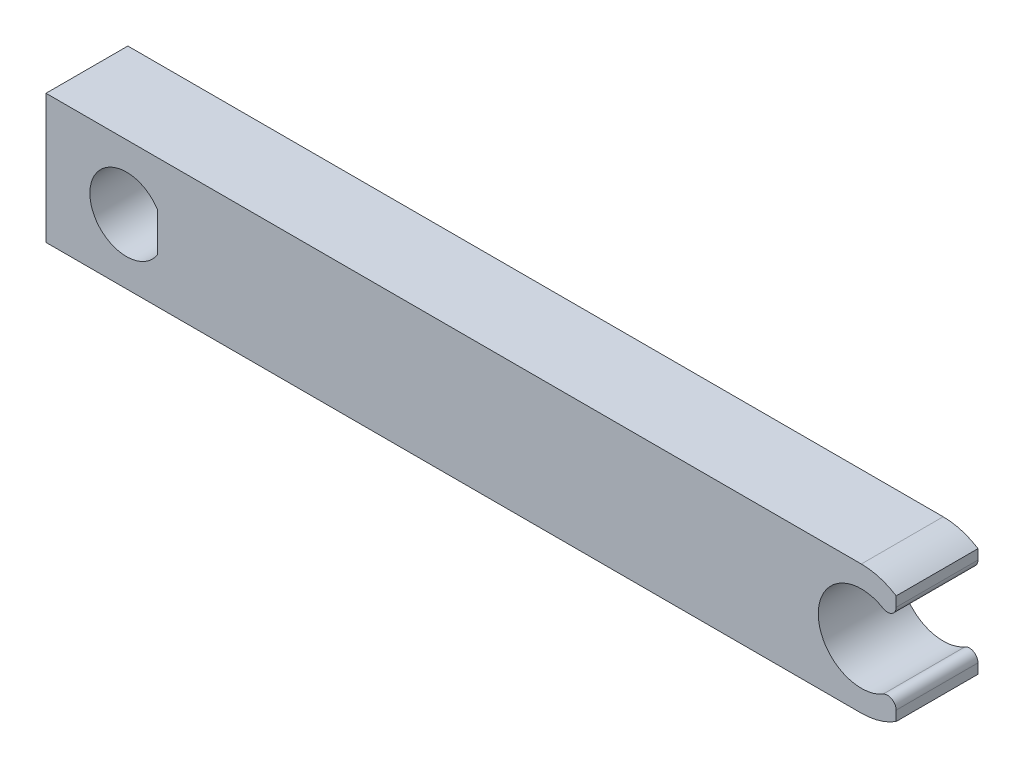
ISO-10303-21;
HEADER;
FILE_DESCRIPTION(('STEP AP214'),'2;1');
FILE_NAME('part.step','',(''),(''),'','','');
FILE_SCHEMA(('AUTOMOTIVE_DESIGN { 1 0 10303 214 1 1 1 1 }'));
ENDSEC;
DATA;
#1=APPLICATION_CONTEXT('core data for automotive mechanical design processes');
#2=APPLICATION_PROTOCOL_DEFINITION('international standard','automotive_design',2000,#1);
#3=PRODUCT_CONTEXT('',#1,'mechanical');
#4=PRODUCT('Part','Part','',(#3));
#5=PRODUCT_RELATED_PRODUCT_CATEGORY('part','',(#4));
#6=PRODUCT_DEFINITION_FORMATION('','',#4);
#7=PRODUCT_DEFINITION_CONTEXT('part definition',#1,'design');
#8=PRODUCT_DEFINITION('design','',#6,#7);
#9=PRODUCT_DEFINITION_SHAPE('','',#8);
#10=(LENGTH_UNIT() NAMED_UNIT(*) SI_UNIT(.MILLI.,.METRE.));
#11=(NAMED_UNIT(*) PLANE_ANGLE_UNIT() SI_UNIT($,.RADIAN.));
#12=(NAMED_UNIT(*) SI_UNIT($,.STERADIAN.) SOLID_ANGLE_UNIT());
#13=UNCERTAINTY_MEASURE_WITH_UNIT(LENGTH_MEASURE(1.E-05),#10,'distance_accuracy_value','');
#14=(GEOMETRIC_REPRESENTATION_CONTEXT(3) GLOBAL_UNCERTAINTY_ASSIGNED_CONTEXT((#13)) GLOBAL_UNIT_ASSIGNED_CONTEXT((#10,
#11,#12)) REPRESENTATION_CONTEXT('',''));
#15=CARTESIAN_POINT('',(0.,0.,0.));
#16=DIRECTION('',(0.,0.,1.));
#17=DIRECTION('',(1.,0.,0.));
#18=AXIS2_PLACEMENT_3D('',#15,#16,#17);
#19=CARTESIAN_POINT('',(0.,12.,7.6));
#20=DIRECTION('',(0.,1.,0.));
#21=DIRECTION('',(-1.,0.,0.));
#22=AXIS2_PLACEMENT_3D('',#19,#20,#21);
#23=PLANE('',#22);
#24=DIRECTION('',(1.,0.,0.));
#25=VECTOR('',#24,1.);
#26=CARTESIAN_POINT('',(0.,12.,0.));
#27=LINE('',#26,#25);
#28=CARTESIAN_POINT('',(-21.8018919920063,11.9999999999999,0.));
#29=VERTEX_POINT('',#28);
#30=CARTESIAN_POINT('',(53.9156905575242,12.,0.));
#31=VERTEX_POINT('',#30);
#32=EDGE_CURVE('E158',#29,#31,#27,.T.);
#33=ORIENTED_EDGE('',*,*,#32,.F.);
#34=DIRECTION('',(0.,0.,-1.));
#35=VECTOR('',#34,1.);
#36=CARTESIAN_POINT('',(-21.8018919920063,11.9999999999999,7.6));
#37=LINE('',#36,#35);
#38=CARTESIAN_POINT('',(-21.8018919920063,11.9999999999999,7.6));
#39=VERTEX_POINT('',#38);
#40=EDGE_CURVE('E246',#39,#29,#37,.T.);
#41=ORIENTED_EDGE('',*,*,#40,.F.);
#42=DIRECTION('',(1.,0.,0.));
#43=VECTOR('',#42,1.);
#44=CARTESIAN_POINT('',(0.,12.,7.6));
#45=LINE('',#44,#43);
#46=CARTESIAN_POINT('',(53.9156905575242,12.,7.6));
#47=VERTEX_POINT('',#46);
#48=EDGE_CURVE('E172',#39,#47,#45,.T.);
#49=ORIENTED_EDGE('',*,*,#48,.T.);
#50=DIRECTION('',(0.,0.,-1.));
#51=VECTOR('',#50,1.);
#52=CARTESIAN_POINT('',(53.9156905575242,12.,7.6));
#53=LINE('',#52,#51);
#54=EDGE_CURVE('E145',#47,#31,#53,.T.);
#55=ORIENTED_EDGE('',*,*,#54,.T.);
#56=EDGE_LOOP('',(#33,#41,#49,#55));
#57=FACE_BOUND('',#56,.T.);
#58=ADVANCED_FACE('F45',(#57),#23,.T.);
#59=CARTESIAN_POINT('',(-21.8018919920063,0.,7.6));
#60=DIRECTION('',(1.,0.,0.));
#61=DIRECTION('',(0.,1.,0.));
#62=AXIS2_PLACEMENT_3D('',#59,#60,#61);
#63=PLANE('',#62);
#64=DIRECTION('',(0.,-1.,0.));
#65=VECTOR('',#64,1.);
#66=CARTESIAN_POINT('',(-21.8018919920063,0.,0.));
#67=LINE('',#66,#65);
#68=CARTESIAN_POINT('',(-21.8018919920063,0.,0.));
#69=VERTEX_POINT('',#68);
#70=EDGE_CURVE('E201',#29,#69,#67,.T.);
#71=ORIENTED_EDGE('',*,*,#70,.T.);
#72=DIRECTION('',(0.,0.,-1.));
#73=VECTOR('',#72,1.);
#74=CARTESIAN_POINT('',(-21.8018919920063,0.,7.6));
#75=LINE('',#74,#73);
#76=CARTESIAN_POINT('',(-21.8018919920063,0.,7.6));
#77=VERTEX_POINT('',#76);
#78=EDGE_CURVE('E242',#77,#69,#75,.T.);
#79=ORIENTED_EDGE('',*,*,#78,.F.);
#80=DIRECTION('',(0.,-1.,0.));
#81=VECTOR('',#80,1.);
#82=CARTESIAN_POINT('',(-21.8018919920063,0.,7.6));
#83=LINE('',#82,#81);
#84=EDGE_CURVE('E176',#39,#77,#83,.T.);
#85=ORIENTED_EDGE('',*,*,#84,.F.);
#86=ORIENTED_EDGE('',*,*,#40,.T.);
#87=EDGE_LOOP('',(#71,#79,#85,#86));
#88=FACE_BOUND('',#87,.T.);
#89=ADVANCED_FACE('F296',(#88),#63,.F.);
#90=CARTESIAN_POINT('',(0.,0.,7.6));
#91=DIRECTION('',(0.,1.,0.));
#92=DIRECTION('',(0.,0.,1.));
#93=AXIS2_PLACEMENT_3D('',#90,#91,#92);
#94=PLANE('',#93);
#95=DIRECTION('',(1.,0.,0.));
#96=VECTOR('',#95,1.);
#97=CARTESIAN_POINT('',(0.,0.,0.));
#98=LINE('',#97,#96);
#99=CARTESIAN_POINT('',(53.9156905575242,0.,0.));
#100=VERTEX_POINT('',#99);
#101=EDGE_CURVE('E204',#69,#100,#98,.T.);
#102=ORIENTED_EDGE('',*,*,#101,.T.);
#103=DIRECTION('',(0.,0.,-1.));
#104=VECTOR('',#103,1.);
#105=CARTESIAN_POINT('',(53.9156905575242,0.,7.6));
#106=LINE('',#105,#104);
#107=CARTESIAN_POINT('',(53.9156905575242,0.,7.6));
#108=VERTEX_POINT('',#107);
#109=EDGE_CURVE('E238',#108,#100,#106,.T.);
#110=ORIENTED_EDGE('',*,*,#109,.F.);
#111=DIRECTION('',(1.,0.,0.));
#112=VECTOR('',#111,1.);
#113=CARTESIAN_POINT('',(0.,0.,7.6));
#114=LINE('',#113,#112);
#115=EDGE_CURVE('E179',#77,#108,#114,.T.);
#116=ORIENTED_EDGE('',*,*,#115,.F.);
#117=ORIENTED_EDGE('',*,*,#78,.T.);
#118=EDGE_LOOP('',(#102,#110,#116,#117));
#119=FACE_BOUND('',#118,.T.);
#120=ADVANCED_FACE('F291',(#119),#94,.F.);
#121=CARTESIAN_POINT('',(53.9156905575242,6.,7.6));
#122=DIRECTION('',(0.,0.,-1.));
#123=DIRECTION('',(-1.,0.,0.));
#124=AXIS2_PLACEMENT_3D('',#121,#122,#123);
#125=CYLINDRICAL_SURFACE('',#124,6.);
#126=CARTESIAN_POINT('',(53.9156905575242,6.,0.));
#127=DIRECTION('',(0.,0.,1.));
#128=DIRECTION('',(1.,0.,0.));
#129=AXIS2_PLACEMENT_3D('',#126,#127,#128);
#130=CIRCLE('',#129,6.);
#131=CARTESIAN_POINT('',(57.1502701108868,0.946536325155928,0.));
#132=VERTEX_POINT('',#131);
#133=EDGE_CURVE('E207',#100,#132,#130,.T.);
#134=ORIENTED_EDGE('',*,*,#133,.T.);
#135=DIRECTION('',(0.,0.,-1.));
#136=VECTOR('',#135,1.);
#137=CARTESIAN_POINT('',(57.1502701108868,0.946536325155928,7.6));
#138=LINE('',#137,#136);
#139=CARTESIAN_POINT('',(57.1502701108868,0.946536325155928,7.6));
#140=VERTEX_POINT('',#139);
#141=EDGE_CURVE('E234',#140,#132,#138,.T.);
#142=ORIENTED_EDGE('',*,*,#141,.F.);
#143=CARTESIAN_POINT('',(53.9156905575242,6.,7.6));
#144=DIRECTION('',(0.,0.,1.));
#145=DIRECTION('',(1.,0.,0.));
#146=AXIS2_PLACEMENT_3D('',#143,#144,#145);
#147=CIRCLE('',#146,6.);
#148=EDGE_CURVE('E182',#108,#140,#147,.T.);
#149=ORIENTED_EDGE('',*,*,#148,.F.);
#150=ORIENTED_EDGE('',*,*,#109,.T.);
#151=EDGE_LOOP('',(#134,#142,#149,#150));
#152=FACE_BOUND('',#151,.T.);
#153=ADVANCED_FACE('F285',(#152),#125,.T.);
#154=CARTESIAN_POINT('',(57.1502701108868,0.,7.6));
#155=DIRECTION('',(1.,0.,0.));
#156=DIRECTION('',(0.,0.,-1.));
#157=AXIS2_PLACEMENT_3D('',#154,#155,#156);
#158=PLANE('',#157);
#159=DIRECTION('',(0.,-1.,0.));
#160=VECTOR('',#159,1.);
#161=CARTESIAN_POINT('',(57.1502701108868,0.,0.));
#162=LINE('',#161,#160);
#163=CARTESIAN_POINT('',(57.1502701108868,1.86323527399146,0.));
#164=VERTEX_POINT('',#163);
#165=EDGE_CURVE('E211',#164,#132,#162,.T.);
#166=ORIENTED_EDGE('',*,*,#165,.F.);
#167=DIRECTION('',(0.,0.,-1.));
#168=VECTOR('',#167,1.);
#169=CARTESIAN_POINT('',(57.1502701108868,1.86323527399146,7.6));
#170=LINE('',#169,#168);
#171=CARTESIAN_POINT('',(57.1502701108868,1.86323527399146,7.6));
#172=VERTEX_POINT('',#171);
#173=EDGE_CURVE('E69',#164,#172,#170,.F.);
#174=ORIENTED_EDGE('',*,*,#173,.T.);
#175=DIRECTION('',(0.,-1.,0.));
#176=VECTOR('',#175,1.);
#177=CARTESIAN_POINT('',(57.1502701108868,0.,7.6));
#178=LINE('',#177,#176);
#179=EDGE_CURVE('E186',#172,#140,#178,.T.);
#180=ORIENTED_EDGE('',*,*,#179,.T.);
#181=ORIENTED_EDGE('',*,*,#141,.T.);
#182=EDGE_LOOP('',(#166,#174,#180,#181));
#183=FACE_BOUND('',#182,.T.);
#184=ADVANCED_FACE('F281',(#183),#158,.T.);
#185=CARTESIAN_POINT('',(53.9156905575242,6.,7.6));
#186=DIRECTION('',(0.,0.,-1.));
#187=DIRECTION('',(-1.,0.,0.));
#188=AXIS2_PLACEMENT_3D('',#185,#186,#187);
#189=CYLINDRICAL_SURFACE('',#188,3.99999999999998);
#190=CARTESIAN_POINT('',(53.9156905575242,6.,7.6));
#191=DIRECTION('',(0.,0.,1.));
#192=DIRECTION('',(1.,0.,0.));
#193=AXIS2_PLACEMENT_3D('',#190,#191,#192);
#194=CIRCLE('',#193,3.99999999999998);
#195=CARTESIAN_POINT('',(55.944506851993,9.44730393834045,7.6));
#196=VERTEX_POINT('',#195);
#197=CARTESIAN_POINT('',(55.944506851993,2.55269606165955,7.6));
#198=VERTEX_POINT('',#197);
#199=EDGE_CURVE('E189',#196,#198,#194,.T.);
#200=ORIENTED_EDGE('',*,*,#199,.T.);
#201=DIRECTION('',(0.,0.,-1.));
#202=VECTOR('',#201,1.);
#203=CARTESIAN_POINT('',(55.944506851993,2.55269606165955,7.6));
#204=LINE('',#203,#202);
#205=CARTESIAN_POINT('',(55.944506851993,2.55269606165955,0.));
#206=VERTEX_POINT('',#205);
#207=EDGE_CURVE('E254',#198,#206,#204,.T.);
#208=ORIENTED_EDGE('',*,*,#207,.T.);
#209=CARTESIAN_POINT('',(53.9156905575242,6.,0.));
#210=DIRECTION('',(0.,0.,1.));
#211=DIRECTION('',(1.,0.,0.));
#212=AXIS2_PLACEMENT_3D('',#209,#210,#211);
#213=CIRCLE('',#212,3.99999999999998);
#214=CARTESIAN_POINT('',(55.944506851993,9.44730393834045,0.));
#215=VERTEX_POINT('',#214);
#216=EDGE_CURVE('E214',#215,#206,#213,.T.);
#217=ORIENTED_EDGE('',*,*,#216,.F.);
#218=DIRECTION('',(0.,0.,-1.));
#219=VECTOR('',#218,1.);
#220=CARTESIAN_POINT('',(55.944506851993,9.44730393834045,7.6));
#221=LINE('',#220,#219);
#222=EDGE_CURVE('E251',#215,#196,#221,.F.);
#223=ORIENTED_EDGE('',*,*,#222,.T.);
#224=EDGE_LOOP('',(#200,#208,#217,#223));
#225=FACE_BOUND('',#224,.T.);
#226=ADVANCED_FACE('F273',(#225),#189,.F.);
#227=CARTESIAN_POINT('',(57.1502701108868,0.,7.6));
#228=DIRECTION('',(1.,0.,0.));
#229=DIRECTION('',(0.,0.,-1.));
#230=AXIS2_PLACEMENT_3D('',#227,#228,#229);
#231=PLANE('',#230);
#232=DIRECTION('',(0.,-1.,0.));
#233=VECTOR('',#232,1.);
#234=CARTESIAN_POINT('',(57.1502701108868,0.,7.6));
#235=LINE('',#234,#233);
#236=CARTESIAN_POINT('',(57.1502701108868,11.0534636748441,7.6));
#237=VERTEX_POINT('',#236);
#238=CARTESIAN_POINT('',(57.1502701108868,10.1367647260085,7.6));
#239=VERTEX_POINT('',#238);
#240=EDGE_CURVE('E193',#237,#239,#235,.T.);
#241=ORIENTED_EDGE('',*,*,#240,.T.);
#242=DIRECTION('',(0.,0.,-1.));
#243=VECTOR('',#242,1.);
#244=CARTESIAN_POINT('',(57.1502701108868,10.1367647260085,7.6));
#245=LINE('',#244,#243);
#246=CARTESIAN_POINT('',(57.1502701108868,10.1367647260085,0.));
#247=VERTEX_POINT('',#246);
#248=EDGE_CURVE('E11',#239,#247,#245,.T.);
#249=ORIENTED_EDGE('',*,*,#248,.T.);
#250=DIRECTION('',(0.,-1.,0.));
#251=VECTOR('',#250,1.);
#252=CARTESIAN_POINT('',(57.1502701108868,0.,0.));
#253=LINE('',#252,#251);
#254=CARTESIAN_POINT('',(57.1502701108868,11.0534636748441,0.));
#255=VERTEX_POINT('',#254);
#256=EDGE_CURVE('E218',#255,#247,#253,.T.);
#257=ORIENTED_EDGE('',*,*,#256,.F.);
#258=DIRECTION('',(0.,0.,-1.));
#259=VECTOR('',#258,1.);
#260=CARTESIAN_POINT('',(57.1502701108868,11.0534636748441,7.6));
#261=LINE('',#260,#259);
#262=EDGE_CURVE('E231',#237,#255,#261,.T.);
#263=ORIENTED_EDGE('',*,*,#262,.F.);
#264=EDGE_LOOP('',(#241,#249,#257,#263));
#265=FACE_BOUND('',#264,.T.);
#266=ADVANCED_FACE('F304',(#265),#231,.T.);
#267=CARTESIAN_POINT('',(53.9156905575242,6.,7.6));
#268=DIRECTION('',(0.,0.,-1.));
#269=DIRECTION('',(-1.,0.,0.));
#270=AXIS2_PLACEMENT_3D('',#267,#268,#269);
#271=CYLINDRICAL_SURFACE('',#270,6.);
#272=CARTESIAN_POINT('',(53.9156905575242,6.,0.));
#273=DIRECTION('',(0.,0.,1.));
#274=DIRECTION('',(1.,0.,0.));
#275=AXIS2_PLACEMENT_3D('',#272,#273,#274);
#276=CIRCLE('',#275,6.);
#277=EDGE_CURVE('E222',#255,#31,#276,.T.);
#278=ORIENTED_EDGE('',*,*,#277,.T.);
#279=ORIENTED_EDGE('',*,*,#54,.F.);
#280=CARTESIAN_POINT('',(53.9156905575242,6.,7.6));
#281=DIRECTION('',(0.,0.,1.));
#282=DIRECTION('',(1.,0.,0.));
#283=AXIS2_PLACEMENT_3D('',#280,#281,#282);
#284=CIRCLE('',#283,6.);
#285=EDGE_CURVE('E146',#237,#47,#284,.T.);
#286=ORIENTED_EDGE('',*,*,#285,.F.);
#287=ORIENTED_EDGE('',*,*,#262,.T.);
#288=EDGE_LOOP('',(#278,#279,#286,#287));
#289=FACE_BOUND('',#288,.T.);
#290=ADVANCED_FACE('F329',(#289),#271,.T.);
#291=CARTESIAN_POINT('',(-14.3269559424758,6.,7.6));
#292=DIRECTION('',(0.,0.,-1.));
#293=DIRECTION('',(-1.,0.,0.));
#294=AXIS2_PLACEMENT_3D('',#291,#292,#293);
#295=CYLINDRICAL_SURFACE('',#294,3.4);
#296=DIRECTION('',(0.,0.,-1.));
#297=VECTOR('',#296,1.);
#298=CARTESIAN_POINT('',(-11.4269559424758,7.77482393492989,7.6));
#299=LINE('',#298,#297);
#300=CARTESIAN_POINT('',(-11.4269559424758,7.77482393492989,7.6));
#301=VERTEX_POINT('',#300);
#302=CARTESIAN_POINT('',(-11.4269559424758,7.77482393492989,0.1));
#303=VERTEX_POINT('',#302);
#304=EDGE_CURVE('E149',#301,#303,#299,.T.);
#305=ORIENTED_EDGE('',*,*,#304,.F.);
#306=CARTESIAN_POINT('',(-14.3269559424758,6.,7.6));
#307=DIRECTION('',(0.,0.,1.));
#308=DIRECTION('',(1.,0.,0.));
#309=AXIS2_PLACEMENT_3D('',#306,#307,#308);
#310=CIRCLE('',#309,3.4);
#311=CARTESIAN_POINT('',(-11.4269559424758,4.22517606507011,7.6));
#312=VERTEX_POINT('',#311);
#313=EDGE_CURVE('E137',#301,#312,#310,.T.);
#314=ORIENTED_EDGE('',*,*,#313,.T.);
#315=DIRECTION('',(0.,0.,1.));
#316=VECTOR('',#315,1.);
#317=CARTESIAN_POINT('',(-11.4269559424758,4.22517606507011,0.1));
#318=LINE('',#317,#316);
#319=CARTESIAN_POINT('',(-11.4269559424758,4.22517606507011,0.1));
#320=VERTEX_POINT('',#319);
#321=EDGE_CURVE('E159',#320,#312,#318,.T.);
#322=ORIENTED_EDGE('',*,*,#321,.F.);
#323=CARTESIAN_POINT('',(-14.3269559424758,6.,0.1));
#324=DIRECTION('',(0.,0.,-1.));
#325=DIRECTION('',(-1.,0.,0.));
#326=AXIS2_PLACEMENT_3D('',#323,#324,#325);
#327=CIRCLE('',#326,3.4);
#328=EDGE_CURVE('E153',#303,#320,#327,.T.);
#329=ORIENTED_EDGE('',*,*,#328,.F.);
#330=EDGE_LOOP('',(#305,#314,#322,#329));
#331=FACE_BOUND('',#330,.T.);
#332=CARTESIAN_POINT('',(-14.3269559424758,6.,0.));
#333=DIRECTION('',(0.,0.,1.));
#334=DIRECTION('',(1.,0.,0.));
#335=AXIS2_PLACEMENT_3D('',#332,#333,#334);
#336=CIRCLE('',#335,3.4);
#337=CARTESIAN_POINT('',(-10.9269559424758,6.,0.));
#338=VERTEX_POINT('',#337);
#339=EDGE_CURVE('E177',#338,#338,#336,.T.);
#340=ORIENTED_EDGE('',*,*,#339,.F.);
#341=EDGE_LOOP('',(#340));
#342=FACE_BOUND('',#341,.T.);
#343=ADVANCED_FACE('F150',(#331,#342),#295,.F.);
#344=CARTESIAN_POINT('',(0.,0.,7.6));
#345=DIRECTION('',(0.,0.,1.));
#346=DIRECTION('',(1.,0.,0.));
#347=AXIS2_PLACEMENT_3D('',#344,#345,#346);
#348=PLANE('',#347);
#349=ORIENTED_EDGE('',*,*,#313,.F.);
#350=DIRECTION('',(0.,-1.,0.));
#351=VECTOR('',#350,1.);
#352=CARTESIAN_POINT('',(-11.4269559424758,4.22517606507011,7.6));
#353=LINE('',#352,#351);
#354=EDGE_CURVE('E141',#301,#312,#353,.T.);
#355=ORIENTED_EDGE('',*,*,#354,.T.);
#356=EDGE_LOOP('',(#349,#355));
#357=FACE_BOUND('',#356,.T.);
#358=ORIENTED_EDGE('',*,*,#179,.F.);
#359=CARTESIAN_POINT('',(56.3502701108868,1.86323527399146,7.6));
#360=DIRECTION('',(0.,0.,1.));
#361=DIRECTION('',(1.,0.,0.));
#362=AXIS2_PLACEMENT_3D('',#359,#360,#361);
#363=CIRCLE('',#362,0.8);
#364=EDGE_CURVE('E54',#172,#198,#363,.T.);
#365=ORIENTED_EDGE('',*,*,#364,.T.);
#366=ORIENTED_EDGE('',*,*,#199,.F.);
#367=CARTESIAN_POINT('',(56.3502701108868,10.1367647260085,7.6));
#368=DIRECTION('',(0.,0.,1.));
#369=DIRECTION('',(1.,0.,0.));
#370=AXIS2_PLACEMENT_3D('',#367,#368,#369);
#371=CIRCLE('',#370,0.8);
#372=EDGE_CURVE('E61',#196,#239,#371,.T.);
#373=ORIENTED_EDGE('',*,*,#372,.T.);
#374=ORIENTED_EDGE('',*,*,#240,.F.);
#375=ORIENTED_EDGE('',*,*,#285,.T.);
#376=ORIENTED_EDGE('',*,*,#48,.F.);
#377=ORIENTED_EDGE('',*,*,#84,.T.);
#378=ORIENTED_EDGE('',*,*,#115,.T.);
#379=ORIENTED_EDGE('',*,*,#148,.T.);
#380=EDGE_LOOP('',(#358,#365,#366,#373,#374,#375,#376,#377,#378,#379));
#381=FACE_BOUND('',#380,.T.);
#382=ADVANCED_FACE('F139',(#357,#381),#348,.T.);
#383=CARTESIAN_POINT('',(0.,0.,0.));
#384=DIRECTION('',(0.,0.,1.));
#385=DIRECTION('',(1.,0.,0.));
#386=AXIS2_PLACEMENT_3D('',#383,#384,#385);
#387=PLANE('',#386);
#388=ORIENTED_EDGE('',*,*,#216,.T.);
#389=CARTESIAN_POINT('',(56.3502701108868,1.86323527399146,0.));
#390=DIRECTION('',(0.,0.,1.));
#391=DIRECTION('',(1.,0.,0.));
#392=AXIS2_PLACEMENT_3D('',#389,#390,#391);
#393=CIRCLE('',#392,0.8);
#394=EDGE_CURVE('E261',#206,#164,#393,.F.);
#395=ORIENTED_EDGE('',*,*,#394,.T.);
#396=ORIENTED_EDGE('',*,*,#165,.T.);
#397=ORIENTED_EDGE('',*,*,#133,.F.);
#398=ORIENTED_EDGE('',*,*,#101,.F.);
#399=ORIENTED_EDGE('',*,*,#70,.F.);
#400=ORIENTED_EDGE('',*,*,#32,.T.);
#401=ORIENTED_EDGE('',*,*,#277,.F.);
#402=ORIENTED_EDGE('',*,*,#256,.T.);
#403=CARTESIAN_POINT('',(56.3502701108868,10.1367647260085,0.));
#404=DIRECTION('',(0.,0.,1.));
#405=DIRECTION('',(1.,0.,0.));
#406=AXIS2_PLACEMENT_3D('',#403,#404,#405);
#407=CIRCLE('',#406,0.8);
#408=EDGE_CURVE('E258',#247,#215,#407,.F.);
#409=ORIENTED_EDGE('',*,*,#408,.T.);
#410=EDGE_LOOP('',(#388,#395,#396,#397,#398,#399,#400,#401,#402,#409));
#411=FACE_BOUND('',#410,.T.);
#412=ORIENTED_EDGE('',*,*,#339,.T.);
#413=EDGE_LOOP('',(#412));
#414=FACE_BOUND('',#413,.T.);
#415=ADVANCED_FACE('F278',(#411,#414),#387,.F.);
#416=CARTESIAN_POINT('',(0.,0.,0.1));
#417=DIRECTION('',(0.,0.,-1.));
#418=DIRECTION('',(-1.,0.,0.));
#419=AXIS2_PLACEMENT_3D('',#416,#417,#418);
#420=PLANE('',#419);
#421=DIRECTION('',(0.,-1.,0.));
#422=VECTOR('',#421,1.);
#423=CARTESIAN_POINT('',(-11.4269559424758,4.22517606507011,0.1));
#424=LINE('',#423,#422);
#425=EDGE_CURVE('E163',#303,#320,#424,.T.);
#426=ORIENTED_EDGE('',*,*,#425,.F.);
#427=ORIENTED_EDGE('',*,*,#328,.T.);
#428=EDGE_LOOP('',(#426,#427));
#429=FACE_BOUND('',#428,.T.);
#430=ADVANCED_FACE('F336',(#429),#420,.T.);
#431=CARTESIAN_POINT('',(-11.4269559424758,4.22517606507011,0.1));
#432=DIRECTION('',(-1.,0.,0.));
#433=DIRECTION('',(0.,0.,1.));
#434=AXIS2_PLACEMENT_3D('',#431,#432,#433);
#435=PLANE('',#434);
#436=ORIENTED_EDGE('',*,*,#354,.F.);
#437=ORIENTED_EDGE('',*,*,#304,.T.);
#438=ORIENTED_EDGE('',*,*,#425,.T.);
#439=ORIENTED_EDGE('',*,*,#321,.T.);
#440=EDGE_LOOP('',(#436,#437,#438,#439));
#441=FACE_BOUND('',#440,.T.);
#442=ADVANCED_FACE('F161',(#441),#435,.T.);
#443=CARTESIAN_POINT('',(56.3502701108868,1.86323527399146,7.6));
#444=DIRECTION('',(0.,0.,-1.));
#445=DIRECTION('',(-1.,0.,0.));
#446=AXIS2_PLACEMENT_3D('',#443,#444,#445);
#447=CYLINDRICAL_SURFACE('',#446,0.8);
#448=ORIENTED_EDGE('',*,*,#364,.F.);
#449=ORIENTED_EDGE('',*,*,#173,.F.);
#450=ORIENTED_EDGE('',*,*,#394,.F.);
#451=ORIENTED_EDGE('',*,*,#207,.F.);
#452=EDGE_LOOP('',(#448,#449,#450,#451));
#453=FACE_BOUND('',#452,.T.);
#454=ADVANCED_FACE('F276',(#453),#447,.T.);
#455=CARTESIAN_POINT('',(56.3502701108868,10.1367647260085,7.6));
#456=DIRECTION('',(0.,0.,-1.));
#457=DIRECTION('',(-1.,0.,0.));
#458=AXIS2_PLACEMENT_3D('',#455,#456,#457);
#459=CYLINDRICAL_SURFACE('',#458,0.8);
#460=ORIENTED_EDGE('',*,*,#372,.F.);
#461=ORIENTED_EDGE('',*,*,#222,.F.);
#462=ORIENTED_EDGE('',*,*,#408,.F.);
#463=ORIENTED_EDGE('',*,*,#248,.F.);
#464=EDGE_LOOP('',(#460,#461,#462,#463));
#465=FACE_BOUND('',#464,.T.);
#466=ADVANCED_FACE('F47',(#465),#459,.T.);
#467=CLOSED_SHELL('',(#58,#89,#120,#153,#184,#226,#266,#290,#343,#382,#415,#430,#442,#454,#466));
#468=MANIFOLD_SOLID_BREP('B2',#467);
#469=ADVANCED_BREP_SHAPE_REPRESENTATION('',(#18,#468),#14);
#470=SHAPE_DEFINITION_REPRESENTATION(#9,#469);
ENDSEC;
END-ISO-10303-21;
